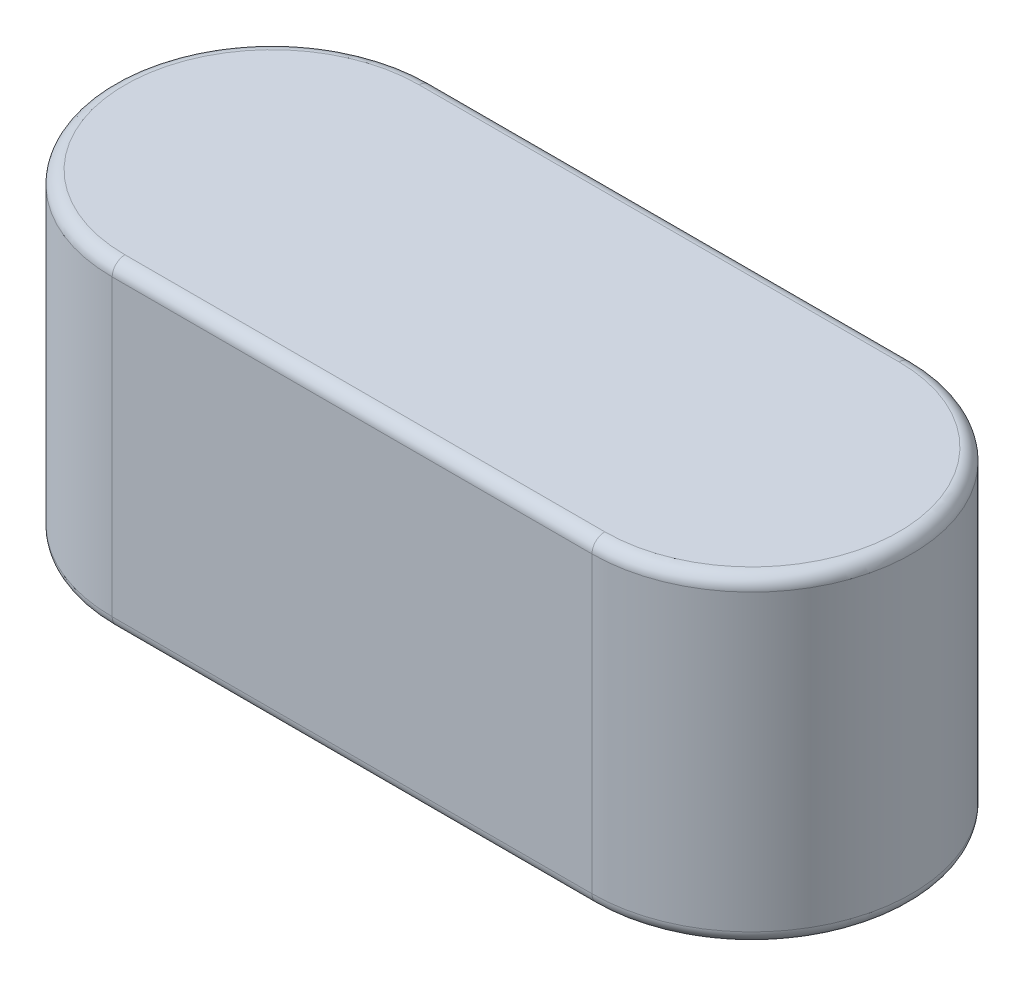
ISO-10303-21;
HEADER;
FILE_DESCRIPTION(('STEP AP214'),'2;1');
FILE_NAME('part.step','',(''),(''),'','','');
FILE_SCHEMA(('AUTOMOTIVE_DESIGN { 1 0 10303 214 1 1 1 1 }'));
ENDSEC;
DATA;
#1=APPLICATION_CONTEXT('core data for automotive mechanical design processes');
#2=APPLICATION_PROTOCOL_DEFINITION('international standard','automotive_design',2000,#1);
#3=PRODUCT_CONTEXT('',#1,'mechanical');
#4=PRODUCT('Part','Part','',(#3));
#5=PRODUCT_RELATED_PRODUCT_CATEGORY('part','',(#4));
#6=PRODUCT_DEFINITION_FORMATION('','',#4);
#7=PRODUCT_DEFINITION_CONTEXT('part definition',#1,'design');
#8=PRODUCT_DEFINITION('design','',#6,#7);
#9=PRODUCT_DEFINITION_SHAPE('','',#8);
#10=(LENGTH_UNIT() NAMED_UNIT(*) SI_UNIT(.MILLI.,.METRE.));
#11=(NAMED_UNIT(*) PLANE_ANGLE_UNIT() SI_UNIT($,.RADIAN.));
#12=(NAMED_UNIT(*) SI_UNIT($,.STERADIAN.) SOLID_ANGLE_UNIT());
#13=UNCERTAINTY_MEASURE_WITH_UNIT(LENGTH_MEASURE(1.E-05),#10,'distance_accuracy_value','');
#14=(GEOMETRIC_REPRESENTATION_CONTEXT(3) GLOBAL_UNCERTAINTY_ASSIGNED_CONTEXT((#13)) GLOBAL_UNIT_ASSIGNED_CONTEXT((#10,
#11,#12)) REPRESENTATION_CONTEXT('',''));
#15=CARTESIAN_POINT('',(0.,0.,0.));
#16=DIRECTION('',(0.,0.,1.));
#17=DIRECTION('',(1.,0.,0.));
#18=AXIS2_PLACEMENT_3D('',#15,#16,#17);
#19=CARTESIAN_POINT('',(-6.00000000000001,4.,0.));
#20=DIRECTION('',(0.,-1.,0.));
#21=DIRECTION('',(0.,0.,-1.));
#22=AXIS2_PLACEMENT_3D('',#19,#20,#21);
#23=CYLINDRICAL_SURFACE('',#22,2.00000000000001);
#24=DIRECTION('',(0.,-1.,0.));
#25=VECTOR('',#24,1.);
#26=CARTESIAN_POINT('',(-6.00000000000001,4.,-2.00000000000001));
#27=LINE('',#26,#25);
#28=CARTESIAN_POINT('',(-6.00000000000001,3.84,-2.00000000000001));
#29=VERTEX_POINT('',#28);
#30=CARTESIAN_POINT('',(-6.00000000000001,0.16,-2.00000000000001));
#31=VERTEX_POINT('',#30);
#32=EDGE_CURVE('E103',#29,#31,#27,.T.);
#33=ORIENTED_EDGE('',*,*,#32,.T.);
#34=CARTESIAN_POINT('',(-6.00000000000001,0.16,0.));
#35=DIRECTION('',(0.,1.,0.));
#36=DIRECTION('',(0.,0.,1.));
#37=AXIS2_PLACEMENT_3D('',#34,#35,#36);
#38=CIRCLE('',#37,2.00000000000001);
#39=CARTESIAN_POINT('',(-6.00000000000001,0.16,2.));
#40=VERTEX_POINT('',#39);
#41=EDGE_CURVE('E110',#31,#40,#38,.T.);
#42=ORIENTED_EDGE('',*,*,#41,.T.);
#43=DIRECTION('',(0.,-1.,0.));
#44=VECTOR('',#43,1.);
#45=CARTESIAN_POINT('',(-6.00000000000001,4.,2.));
#46=LINE('',#45,#44);
#47=CARTESIAN_POINT('',(-6.00000000000001,3.84,2.));
#48=VERTEX_POINT('',#47);
#49=EDGE_CURVE('E105',#48,#40,#46,.T.);
#50=ORIENTED_EDGE('',*,*,#49,.F.);
#51=CARTESIAN_POINT('',(-6.00000000000001,3.84,0.));
#52=DIRECTION('',(0.,1.,0.));
#53=DIRECTION('',(0.,0.,1.));
#54=AXIS2_PLACEMENT_3D('',#51,#52,#53);
#55=CIRCLE('',#54,2.00000000000001);
#56=EDGE_CURVE('E101',#48,#29,#55,.F.);
#57=ORIENTED_EDGE('',*,*,#56,.T.);
#58=EDGE_LOOP('',(#33,#42,#50,#57));
#59=FACE_BOUND('',#58,.T.);
#60=ADVANCED_FACE('F32',(#59),#23,.T.);
#61=CARTESIAN_POINT('',(-6.00000000000001,4.,2.));
#62=DIRECTION('',(0.,0.,-1.));
#63=DIRECTION('',(-1.,0.,0.));
#64=AXIS2_PLACEMENT_3D('',#61,#62,#63);
#65=PLANE('',#64);
#66=ORIENTED_EDGE('',*,*,#49,.T.);
#67=DIRECTION('',(1.,0.,0.));
#68=VECTOR('',#67,1.);
#69=CARTESIAN_POINT('',(-6.00000000000001,0.16,2.));
#70=LINE('',#69,#68);
#71=CARTESIAN_POINT('',(0.,0.16,2.00000000000001));
#72=VERTEX_POINT('',#71);
#73=EDGE_CURVE('E154',#40,#72,#70,.T.);
#74=ORIENTED_EDGE('',*,*,#73,.T.);
#75=DIRECTION('',(0.,-1.,0.));
#76=VECTOR('',#75,1.);
#77=CARTESIAN_POINT('',(0.,4.,2.00000000000001));
#78=LINE('',#77,#76);
#79=CARTESIAN_POINT('',(0.,3.84,2.00000000000001));
#80=VERTEX_POINT('',#79);
#81=EDGE_CURVE('E135',#80,#72,#78,.T.);
#82=ORIENTED_EDGE('',*,*,#81,.F.);
#83=DIRECTION('',(1.,0.,0.));
#84=VECTOR('',#83,1.);
#85=CARTESIAN_POINT('',(-6.00000000000001,3.84,2.));
#86=LINE('',#85,#84);
#87=EDGE_CURVE('E152',#80,#48,#86,.F.);
#88=ORIENTED_EDGE('',*,*,#87,.T.);
#89=EDGE_LOOP('',(#66,#74,#82,#88));
#90=FACE_BOUND('',#89,.T.);
#91=ADVANCED_FACE('F180',(#90),#65,.F.);
#92=CARTESIAN_POINT('',(0.,4.,0.));
#93=DIRECTION('',(0.,-1.,0.));
#94=DIRECTION('',(0.,0.,-1.));
#95=AXIS2_PLACEMENT_3D('',#92,#93,#94);
#96=CYLINDRICAL_SURFACE('',#95,2.00000000000001);
#97=ORIENTED_EDGE('',*,*,#81,.T.);
#98=CARTESIAN_POINT('',(0.,0.16,0.));
#99=DIRECTION('',(0.,1.,0.));
#100=DIRECTION('',(0.,0.,1.));
#101=AXIS2_PLACEMENT_3D('',#98,#99,#100);
#102=CIRCLE('',#101,2.00000000000001);
#103=CARTESIAN_POINT('',(0.,0.16,-2.00000000000001));
#104=VERTEX_POINT('',#103);
#105=EDGE_CURVE('E111',#72,#104,#102,.T.);
#106=ORIENTED_EDGE('',*,*,#105,.T.);
#107=DIRECTION('',(0.,-1.,0.));
#108=VECTOR('',#107,1.);
#109=CARTESIAN_POINT('',(0.,4.,-2.00000000000001));
#110=LINE('',#109,#108);
#111=CARTESIAN_POINT('',(0.,3.84,-2.00000000000001));
#112=VERTEX_POINT('',#111);
#113=EDGE_CURVE('E122',#112,#104,#110,.T.);
#114=ORIENTED_EDGE('',*,*,#113,.F.);
#115=CARTESIAN_POINT('',(0.,3.84,0.));
#116=DIRECTION('',(0.,1.,0.));
#117=DIRECTION('',(0.,0.,1.));
#118=AXIS2_PLACEMENT_3D('',#115,#116,#117);
#119=CIRCLE('',#118,2.00000000000001);
#120=EDGE_CURVE('E147',#112,#80,#119,.F.);
#121=ORIENTED_EDGE('',*,*,#120,.T.);
#122=EDGE_LOOP('',(#97,#106,#114,#121));
#123=FACE_BOUND('',#122,.T.);
#124=ADVANCED_FACE('F178',(#123),#96,.T.);
#125=CARTESIAN_POINT('',(-6.00000000000001,4.,-2.00000000000001));
#126=DIRECTION('',(0.,0.,1.));
#127=DIRECTION('',(1.,0.,0.));
#128=AXIS2_PLACEMENT_3D('',#125,#126,#127);
#129=PLANE('',#128);
#130=ORIENTED_EDGE('',*,*,#113,.T.);
#131=DIRECTION('',(-1.,0.,0.));
#132=VECTOR('',#131,1.);
#133=CARTESIAN_POINT('',(-6.00000000000001,0.16,-2.00000000000001));
#134=LINE('',#133,#132);
#135=EDGE_CURVE('E121',#104,#31,#134,.T.);
#136=ORIENTED_EDGE('',*,*,#135,.T.);
#137=ORIENTED_EDGE('',*,*,#32,.F.);
#138=DIRECTION('',(-1.,0.,0.));
#139=VECTOR('',#138,1.);
#140=CARTESIAN_POINT('',(0.,3.84,-2.00000000000001));
#141=LINE('',#140,#139);
#142=EDGE_CURVE('E118',#29,#112,#141,.F.);
#143=ORIENTED_EDGE('',*,*,#142,.T.);
#144=EDGE_LOOP('',(#130,#136,#137,#143));
#145=FACE_BOUND('',#144,.T.);
#146=ADVANCED_FACE('F116',(#145),#129,.F.);
#147=CARTESIAN_POINT('',(-6.00000000000001,4.,0.));
#148=DIRECTION('',(0.,1.,0.));
#149=DIRECTION('',(0.,0.,1.));
#150=AXIS2_PLACEMENT_3D('',#147,#148,#149);
#151=PLANE('',#150);
#152=DIRECTION('',(1.,0.,0.));
#153=VECTOR('',#152,1.);
#154=CARTESIAN_POINT('',(0.,4.,1.84));
#155=LINE('',#154,#153);
#156=CARTESIAN_POINT('',(-6.00000000000001,4.,1.84000000000001));
#157=VERTEX_POINT('',#156);
#158=CARTESIAN_POINT('',(0.,4.,1.84));
#159=VERTEX_POINT('',#158);
#160=EDGE_CURVE('E41',#157,#159,#155,.T.);
#161=ORIENTED_EDGE('',*,*,#160,.T.);
#162=CARTESIAN_POINT('',(0.,4.,0.));
#163=DIRECTION('',(0.,1.,0.));
#164=DIRECTION('',(0.,0.,1.));
#165=AXIS2_PLACEMENT_3D('',#162,#163,#164);
#166=CIRCLE('',#165,1.84000000000001);
#167=CARTESIAN_POINT('',(0.,4.,-1.84000000000001));
#168=VERTEX_POINT('',#167);
#169=EDGE_CURVE('E11',#159,#168,#166,.T.);
#170=ORIENTED_EDGE('',*,*,#169,.T.);
#171=DIRECTION('',(-1.,0.,0.));
#172=VECTOR('',#171,1.);
#173=CARTESIAN_POINT('',(-6.00000000000001,4.,-1.84000000000001));
#174=LINE('',#173,#172);
#175=CARTESIAN_POINT('',(-6.00000000000001,4.,-1.84000000000001));
#176=VERTEX_POINT('',#175);
#177=EDGE_CURVE('E157',#168,#176,#174,.T.);
#178=ORIENTED_EDGE('',*,*,#177,.T.);
#179=CARTESIAN_POINT('',(-6.00000000000001,4.,0.));
#180=DIRECTION('',(0.,1.,0.));
#181=DIRECTION('',(0.,0.,1.));
#182=AXIS2_PLACEMENT_3D('',#179,#180,#181);
#183=CIRCLE('',#182,1.84000000000001);
#184=EDGE_CURVE('E128',#176,#157,#183,.T.);
#185=ORIENTED_EDGE('',*,*,#184,.T.);
#186=EDGE_LOOP('',(#161,#170,#178,#185));
#187=FACE_BOUND('',#186,.T.);
#188=ADVANCED_FACE('F203',(#187),#151,.T.);
#189=CARTESIAN_POINT('',(-6.00000000000001,0.,0.));
#190=DIRECTION('',(0.,1.,0.));
#191=DIRECTION('',(0.,0.,1.));
#192=AXIS2_PLACEMENT_3D('',#189,#190,#191);
#193=PLANE('',#192);
#194=CARTESIAN_POINT('',(-6.00000000000001,0.,0.));
#195=DIRECTION('',(0.,1.,0.));
#196=DIRECTION('',(0.,0.,1.));
#197=AXIS2_PLACEMENT_3D('',#194,#195,#196);
#198=CIRCLE('',#197,1.84000000000001);
#199=CARTESIAN_POINT('',(-6.00000000000001,0.,1.84));
#200=VERTEX_POINT('',#199);
#201=CARTESIAN_POINT('',(-6.00000000000001,0.,-1.84000000000001));
#202=VERTEX_POINT('',#201);
#203=EDGE_CURVE('E140',#200,#202,#198,.F.);
#204=ORIENTED_EDGE('',*,*,#203,.T.);
#205=DIRECTION('',(-1.,0.,0.));
#206=VECTOR('',#205,1.);
#207=CARTESIAN_POINT('',(-6.00000000000001,0.,-1.84000000000001));
#208=LINE('',#207,#206);
#209=CARTESIAN_POINT('',(0.,0.,-1.84000000000001));
#210=VERTEX_POINT('',#209);
#211=EDGE_CURVE('E144',#202,#210,#208,.F.);
#212=ORIENTED_EDGE('',*,*,#211,.T.);
#213=CARTESIAN_POINT('',(0.,0.,0.));
#214=DIRECTION('',(0.,1.,0.));
#215=DIRECTION('',(0.,0.,1.));
#216=AXIS2_PLACEMENT_3D('',#213,#214,#215);
#217=CIRCLE('',#216,1.84000000000001);
#218=CARTESIAN_POINT('',(0.,0.,1.84));
#219=VERTEX_POINT('',#218);
#220=EDGE_CURVE('E142',#210,#219,#217,.F.);
#221=ORIENTED_EDGE('',*,*,#220,.T.);
#222=DIRECTION('',(1.,0.,0.));
#223=VECTOR('',#222,1.);
#224=CARTESIAN_POINT('',(-6.00000000000001,0.,1.84));
#225=LINE('',#224,#223);
#226=EDGE_CURVE('E133',#219,#200,#225,.F.);
#227=ORIENTED_EDGE('',*,*,#226,.T.);
#228=EDGE_LOOP('',(#204,#212,#221,#227));
#229=FACE_BOUND('',#228,.T.);
#230=ADVANCED_FACE('F201',(#229),#193,.F.);
#231=CARTESIAN_POINT('',(-6.00000000000001,0.16,1.84));
#232=DIRECTION('',(1.,0.,0.));
#233=DIRECTION('',(0.,0.,-1.));
#234=AXIS2_PLACEMENT_3D('',#231,#232,#233);
#235=CYLINDRICAL_SURFACE('',#234,0.16);
#236=CARTESIAN_POINT('',(-6.00000000000001,0.16,1.84));
#237=DIRECTION('',(-1.,0.,0.));
#238=DIRECTION('',(0.,0.,1.));
#239=AXIS2_PLACEMENT_3D('',#236,#237,#238);
#240=CIRCLE('',#239,0.16);
#241=EDGE_CURVE('E164',#200,#40,#240,.T.);
#242=ORIENTED_EDGE('',*,*,#241,.F.);
#243=ORIENTED_EDGE('',*,*,#226,.F.);
#244=CARTESIAN_POINT('',(0.,0.16,1.84));
#245=DIRECTION('',(1.,0.,0.));
#246=DIRECTION('',(0.,0.,-1.));
#247=AXIS2_PLACEMENT_3D('',#244,#245,#246);
#248=CIRCLE('',#247,0.16);
#249=EDGE_CURVE('E123',#72,#219,#248,.T.);
#250=ORIENTED_EDGE('',*,*,#249,.F.);
#251=ORIENTED_EDGE('',*,*,#73,.F.);
#252=EDGE_LOOP('',(#242,#243,#250,#251));
#253=FACE_BOUND('',#252,.T.);
#254=ADVANCED_FACE('F198',(#253),#235,.T.);
#255=CARTESIAN_POINT('',(0.,0.16,0.));
#256=DIRECTION('',(0.,1.,0.));
#257=DIRECTION('',(0.,0.,1.));
#258=AXIS2_PLACEMENT_3D('',#255,#256,#257);
#259=TOROIDAL_SURFACE('',#258,1.84000000000001,0.16);
#260=ORIENTED_EDGE('',*,*,#249,.T.);
#261=ORIENTED_EDGE('',*,*,#220,.F.);
#262=CARTESIAN_POINT('',(0.,0.16,-1.84000000000001));
#263=DIRECTION('',(-1.,0.,0.));
#264=DIRECTION('',(0.,0.,1.));
#265=AXIS2_PLACEMENT_3D('',#262,#263,#264);
#266=CIRCLE('',#265,0.16);
#267=EDGE_CURVE('E162',#104,#210,#266,.T.);
#268=ORIENTED_EDGE('',*,*,#267,.F.);
#269=ORIENTED_EDGE('',*,*,#105,.F.);
#270=EDGE_LOOP('',(#260,#261,#268,#269));
#271=FACE_BOUND('',#270,.T.);
#272=ADVANCED_FACE('F187',(#271),#259,.T.);
#273=CARTESIAN_POINT('',(-6.00000000000001,0.16,0.));
#274=DIRECTION('',(0.,1.,0.));
#275=DIRECTION('',(0.,0.,1.));
#276=AXIS2_PLACEMENT_3D('',#273,#274,#275);
#277=TOROIDAL_SURFACE('',#276,1.84000000000001,0.16);
#278=ORIENTED_EDGE('',*,*,#241,.T.);
#279=ORIENTED_EDGE('',*,*,#41,.F.);
#280=CARTESIAN_POINT('',(-6.00000000000001,0.16,-1.84000000000001));
#281=DIRECTION('',(1.,0.,0.));
#282=DIRECTION('',(0.,0.,-1.));
#283=AXIS2_PLACEMENT_3D('',#280,#281,#282);
#284=CIRCLE('',#283,0.16);
#285=EDGE_CURVE('E160',#202,#31,#284,.T.);
#286=ORIENTED_EDGE('',*,*,#285,.F.);
#287=ORIENTED_EDGE('',*,*,#203,.F.);
#288=EDGE_LOOP('',(#278,#279,#286,#287));
#289=FACE_BOUND('',#288,.T.);
#290=ADVANCED_FACE('F195',(#289),#277,.T.);
#291=CARTESIAN_POINT('',(-6.00000000000001,0.16,-1.84000000000001));
#292=DIRECTION('',(-1.,0.,0.));
#293=DIRECTION('',(0.,0.,1.));
#294=AXIS2_PLACEMENT_3D('',#291,#292,#293);
#295=CYLINDRICAL_SURFACE('',#294,0.16);
#296=ORIENTED_EDGE('',*,*,#267,.T.);
#297=ORIENTED_EDGE('',*,*,#211,.F.);
#298=ORIENTED_EDGE('',*,*,#285,.T.);
#299=ORIENTED_EDGE('',*,*,#135,.F.);
#300=EDGE_LOOP('',(#296,#297,#298,#299));
#301=FACE_BOUND('',#300,.T.);
#302=ADVANCED_FACE('F190',(#301),#295,.T.);
#303=CARTESIAN_POINT('',(-6.00000000000001,3.84,0.));
#304=DIRECTION('',(0.,1.,0.));
#305=DIRECTION('',(0.,0.,1.));
#306=AXIS2_PLACEMENT_3D('',#303,#304,#305);
#307=TOROIDAL_SURFACE('',#306,1.84000000000001,0.16);
#308=CARTESIAN_POINT('',(-6.00000000000001,3.84,-1.84000000000001));
#309=DIRECTION('',(1.,0.,0.));
#310=DIRECTION('',(0.,0.,-1.));
#311=AXIS2_PLACEMENT_3D('',#308,#309,#310);
#312=CIRCLE('',#311,0.16);
#313=EDGE_CURVE('E127',#29,#176,#312,.T.);
#314=ORIENTED_EDGE('',*,*,#313,.F.);
#315=ORIENTED_EDGE('',*,*,#56,.F.);
#316=CARTESIAN_POINT('',(-6.00000000000001,3.84,1.84000000000001));
#317=DIRECTION('',(1.,0.,0.));
#318=DIRECTION('',(0.,0.,-1.));
#319=AXIS2_PLACEMENT_3D('',#316,#317,#318);
#320=CIRCLE('',#319,0.16);
#321=EDGE_CURVE('E36',#157,#48,#320,.T.);
#322=ORIENTED_EDGE('',*,*,#321,.F.);
#323=ORIENTED_EDGE('',*,*,#184,.F.);
#324=EDGE_LOOP('',(#314,#315,#322,#323));
#325=FACE_BOUND('',#324,.T.);
#326=ADVANCED_FACE('F34',(#325),#307,.T.);
#327=CARTESIAN_POINT('',(-6.00000000000001,3.84,1.84));
#328=DIRECTION('',(-1.,0.,0.));
#329=DIRECTION('',(0.,0.,1.));
#330=AXIS2_PLACEMENT_3D('',#327,#328,#329);
#331=CYLINDRICAL_SURFACE('',#330,0.16);
#332=ORIENTED_EDGE('',*,*,#321,.T.);
#333=ORIENTED_EDGE('',*,*,#87,.F.);
#334=CARTESIAN_POINT('',(0.,3.84,1.84));
#335=DIRECTION('',(1.,0.,0.));
#336=DIRECTION('',(0.,0.,-1.));
#337=AXIS2_PLACEMENT_3D('',#334,#335,#336);
#338=CIRCLE('',#337,0.16);
#339=EDGE_CURVE('E130',#159,#80,#338,.T.);
#340=ORIENTED_EDGE('',*,*,#339,.F.);
#341=ORIENTED_EDGE('',*,*,#160,.F.);
#342=EDGE_LOOP('',(#332,#333,#340,#341));
#343=FACE_BOUND('',#342,.T.);
#344=ADVANCED_FACE('F173',(#343),#331,.T.);
#345=CARTESIAN_POINT('',(-6.00000000000001,3.84,-1.84000000000001));
#346=DIRECTION('',(1.,0.,0.));
#347=DIRECTION('',(0.,0.,-1.));
#348=AXIS2_PLACEMENT_3D('',#345,#346,#347);
#349=CYLINDRICAL_SURFACE('',#348,0.16);
#350=ORIENTED_EDGE('',*,*,#313,.T.);
#351=ORIENTED_EDGE('',*,*,#177,.F.);
#352=CARTESIAN_POINT('',(0.,3.84,-1.84000000000001));
#353=DIRECTION('',(1.,0.,0.));
#354=DIRECTION('',(0.,0.,-1.));
#355=AXIS2_PLACEMENT_3D('',#352,#353,#354);
#356=CIRCLE('',#355,0.16);
#357=EDGE_CURVE('E55',#112,#168,#356,.T.);
#358=ORIENTED_EDGE('',*,*,#357,.F.);
#359=ORIENTED_EDGE('',*,*,#142,.F.);
#360=EDGE_LOOP('',(#350,#351,#358,#359));
#361=FACE_BOUND('',#360,.T.);
#362=ADVANCED_FACE('F131',(#361),#349,.T.);
#363=CARTESIAN_POINT('',(0.,3.84,0.));
#364=DIRECTION('',(0.,1.,0.));
#365=DIRECTION('',(0.,0.,1.));
#366=AXIS2_PLACEMENT_3D('',#363,#364,#365);
#367=TOROIDAL_SURFACE('',#366,1.84000000000001,0.16);
#368=ORIENTED_EDGE('',*,*,#339,.T.);
#369=ORIENTED_EDGE('',*,*,#120,.F.);
#370=ORIENTED_EDGE('',*,*,#357,.T.);
#371=ORIENTED_EDGE('',*,*,#169,.F.);
#372=EDGE_LOOP('',(#368,#369,#370,#371));
#373=FACE_BOUND('',#372,.T.);
#374=ADVANCED_FACE('F171',(#373),#367,.T.);
#375=CLOSED_SHELL('',(#60,#91,#124,#146,#188,#230,#254,#272,#290,#302,#326,#344,#362,#374));
#376=MANIFOLD_SOLID_BREP('B2',#375);
#377=ADVANCED_BREP_SHAPE_REPRESENTATION('',(#18,#376),#14);
#378=SHAPE_DEFINITION_REPRESENTATION(#9,#377);
ENDSEC;
END-ISO-10303-21;
